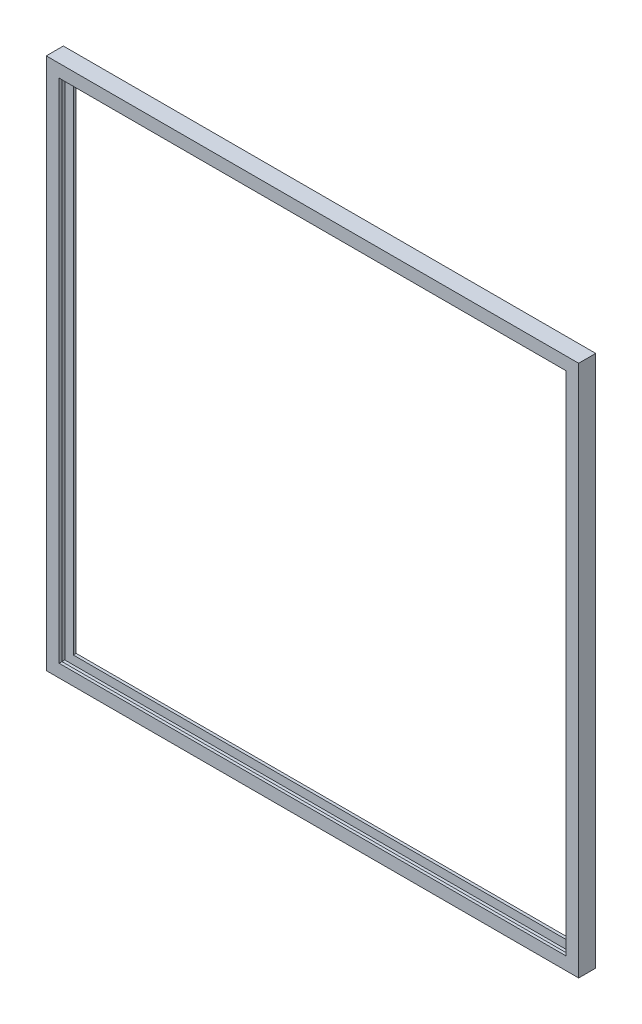
ISO-10303-21;
HEADER;
FILE_DESCRIPTION(('STEP AP214'),'2;1');
FILE_NAME('part.step','',(''),(''),'','','');
FILE_SCHEMA(('AUTOMOTIVE_DESIGN { 1 0 10303 214 1 1 1 1 }'));
ENDSEC;
DATA;
#1=APPLICATION_CONTEXT('core data for automotive mechanical design processes');
#2=APPLICATION_PROTOCOL_DEFINITION('international standard','automotive_design',2000,#1);
#3=PRODUCT_CONTEXT('',#1,'mechanical');
#4=PRODUCT('Part','Part','',(#3));
#5=PRODUCT_RELATED_PRODUCT_CATEGORY('part','',(#4));
#6=PRODUCT_DEFINITION_FORMATION('','',#4);
#7=PRODUCT_DEFINITION_CONTEXT('part definition',#1,'design');
#8=PRODUCT_DEFINITION('design','',#6,#7);
#9=PRODUCT_DEFINITION_SHAPE('','',#8);
#10=(LENGTH_UNIT() NAMED_UNIT(*) SI_UNIT(.MILLI.,.METRE.));
#11=(NAMED_UNIT(*) PLANE_ANGLE_UNIT() SI_UNIT($,.RADIAN.));
#12=(NAMED_UNIT(*) SI_UNIT($,.STERADIAN.) SOLID_ANGLE_UNIT());
#13=UNCERTAINTY_MEASURE_WITH_UNIT(LENGTH_MEASURE(1.E-05),#10,'distance_accuracy_value','');
#14=(GEOMETRIC_REPRESENTATION_CONTEXT(3) GLOBAL_UNCERTAINTY_ASSIGNED_CONTEXT((#13)) GLOBAL_UNIT_ASSIGNED_CONTEXT((#10,
#11,#12)) REPRESENTATION_CONTEXT('',''));
#15=CARTESIAN_POINT('',(0.,0.,0.));
#16=DIRECTION('',(0.,0.,1.));
#17=DIRECTION('',(1.,0.,0.));
#18=AXIS2_PLACEMENT_3D('',#15,#16,#17);
#19=CARTESIAN_POINT('',(-296.8625,593.725,9.525));
#20=DIRECTION('',(-1.,0.,0.));
#21=DIRECTION('',(0.,-1.,0.));
#22=AXIS2_PLACEMENT_3D('',#19,#20,#21);
#23=PLANE('',#22);
#24=DIRECTION('',(0.,-1.,0.));
#25=VECTOR('',#24,1.);
#26=CARTESIAN_POINT('',(-296.8625,593.725,-9.525));
#27=LINE('',#26,#25);
#28=CARTESIAN_POINT('',(-296.8625,593.725,-9.525));
#29=VERTEX_POINT('',#28);
#30=CARTESIAN_POINT('',(-296.8625,0.,-9.525));
#31=VERTEX_POINT('',#30);
#32=EDGE_CURVE('E106',#29,#31,#27,.T.);
#33=ORIENTED_EDGE('',*,*,#32,.T.);
#34=DIRECTION('',(0.,0.,-1.));
#35=VECTOR('',#34,1.);
#36=CARTESIAN_POINT('',(-296.8625,0.,9.525));
#37=LINE('',#36,#35);
#38=CARTESIAN_POINT('',(-296.8625,0.,9.525));
#39=VERTEX_POINT('',#38);
#40=EDGE_CURVE('E146',#39,#31,#37,.T.);
#41=ORIENTED_EDGE('',*,*,#40,.F.);
#42=DIRECTION('',(0.,-1.,0.));
#43=VECTOR('',#42,1.);
#44=CARTESIAN_POINT('',(-296.8625,593.725,9.525));
#45=LINE('',#44,#43);
#46=CARTESIAN_POINT('',(-296.8625,593.725,9.525));
#47=VERTEX_POINT('',#46);
#48=EDGE_CURVE('E121',#47,#39,#45,.T.);
#49=ORIENTED_EDGE('',*,*,#48,.F.);
#50=DIRECTION('',(0.,0.,-1.));
#51=VECTOR('',#50,1.);
#52=CARTESIAN_POINT('',(-296.8625,593.725,9.525));
#53=LINE('',#52,#51);
#54=EDGE_CURVE('E240',#47,#29,#53,.T.);
#55=ORIENTED_EDGE('',*,*,#54,.T.);
#56=EDGE_LOOP('',(#33,#41,#49,#55));
#57=FACE_BOUND('',#56,.T.);
#58=ADVANCED_FACE('F34',(#57),#23,.T.);
#59=CARTESIAN_POINT('',(-282.575,593.725,6.35));
#60=DIRECTION('',(1.,0.,0.));
#61=DIRECTION('',(0.,1.,0.));
#62=AXIS2_PLACEMENT_3D('',#59,#60,#61);
#63=PLANE('',#62);
#64=DIRECTION('',(0.,-1.,0.));
#65=VECTOR('',#64,1.);
#66=CARTESIAN_POINT('',(-282.575,593.725,9.525));
#67=LINE('',#66,#65);
#68=CARTESIAN_POINT('',(-282.575,579.4375,9.525));
#69=VERTEX_POINT('',#68);
#70=CARTESIAN_POINT('',(-282.575,14.2875,9.525));
#71=VERTEX_POINT('',#70);
#72=EDGE_CURVE('E111',#69,#71,#67,.T.);
#73=ORIENTED_EDGE('',*,*,#72,.T.);
#74=DIRECTION('',(0.,0.,-1.));
#75=VECTOR('',#74,1.);
#76=CARTESIAN_POINT('',(-282.575,14.2875,6.35));
#77=LINE('',#76,#75);
#78=CARTESIAN_POINT('',(-282.575,14.2875,6.35));
#79=VERTEX_POINT('',#78);
#80=EDGE_CURVE('E113',#71,#79,#77,.T.);
#81=ORIENTED_EDGE('',*,*,#80,.T.);
#82=DIRECTION('',(0.,-1.,0.));
#83=VECTOR('',#82,1.);
#84=CARTESIAN_POINT('',(-282.575,593.725,6.35));
#85=LINE('',#84,#83);
#86=CARTESIAN_POINT('',(-282.575,579.4375,6.35));
#87=VERTEX_POINT('',#86);
#88=EDGE_CURVE('E122',#87,#79,#85,.T.);
#89=ORIENTED_EDGE('',*,*,#88,.F.);
#90=DIRECTION('',(0.,0.,-1.));
#91=VECTOR('',#90,1.);
#92=CARTESIAN_POINT('',(-282.575,579.4375,6.35));
#93=LINE('',#92,#91);
#94=EDGE_CURVE('E116',#69,#87,#93,.T.);
#95=ORIENTED_EDGE('',*,*,#94,.F.);
#96=EDGE_LOOP('',(#73,#81,#89,#95));
#97=FACE_BOUND('',#96,.T.);
#98=ADVANCED_FACE('F36',(#97),#63,.T.);
#99=CARTESIAN_POINT('',(-282.575,593.725,-9.525));
#100=DIRECTION('',(1.,0.,0.));
#101=DIRECTION('',(0.,0.,-1.));
#102=AXIS2_PLACEMENT_3D('',#99,#100,#101);
#103=PLANE('',#102);
#104=DIRECTION('',(0.,-1.,0.));
#105=VECTOR('',#104,1.);
#106=CARTESIAN_POINT('',(-282.575,593.725,-6.35));
#107=LINE('',#106,#105);
#108=CARTESIAN_POINT('',(-282.575,579.4375,-6.35));
#109=VERTEX_POINT('',#108);
#110=CARTESIAN_POINT('',(-282.575,14.2875,-6.35));
#111=VERTEX_POINT('',#110);
#112=EDGE_CURVE('E170',#109,#111,#107,.T.);
#113=ORIENTED_EDGE('',*,*,#112,.T.);
#114=DIRECTION('',(0.,0.,-1.));
#115=VECTOR('',#114,1.);
#116=CARTESIAN_POINT('',(-282.575,14.2875,-9.52499999999998));
#117=LINE('',#116,#115);
#118=CARTESIAN_POINT('',(-282.575,14.2875,-9.525));
#119=VERTEX_POINT('',#118);
#120=EDGE_CURVE('E162',#111,#119,#117,.T.);
#121=ORIENTED_EDGE('',*,*,#120,.T.);
#122=DIRECTION('',(0.,-1.,0.));
#123=VECTOR('',#122,1.);
#124=CARTESIAN_POINT('',(-282.575,593.725,-9.525));
#125=LINE('',#124,#123);
#126=CARTESIAN_POINT('',(-282.575,579.4375,-9.525));
#127=VERTEX_POINT('',#126);
#128=EDGE_CURVE('E166',#127,#119,#125,.T.);
#129=ORIENTED_EDGE('',*,*,#128,.F.);
#130=DIRECTION('',(0.,0.,-1.));
#131=VECTOR('',#130,1.);
#132=CARTESIAN_POINT('',(-282.575,579.4375,-9.52500000000063));
#133=LINE('',#132,#131);
#134=EDGE_CURVE('E133',#109,#127,#133,.T.);
#135=ORIENTED_EDGE('',*,*,#134,.F.);
#136=EDGE_LOOP('',(#113,#121,#129,#135));
#137=FACE_BOUND('',#136,.T.);
#138=ADVANCED_FACE('F266',(#137),#103,.T.);
#139=CARTESIAN_POINT('',(-292.1,593.725,-6.35));
#140=DIRECTION('',(1.,0.,0.));
#141=DIRECTION('',(0.,1.,0.));
#142=AXIS2_PLACEMENT_3D('',#139,#140,#141);
#143=PLANE('',#142);
#144=DIRECTION('',(0.,-1.,0.));
#145=VECTOR('',#144,1.);
#146=CARTESIAN_POINT('',(-292.1,593.725,6.35));
#147=LINE('',#146,#145);
#148=CARTESIAN_POINT('',(-292.1,588.9625,6.35));
#149=VERTEX_POINT('',#148);
#150=CARTESIAN_POINT('',(-292.1,4.76249999999997,6.35));
#151=VERTEX_POINT('',#150);
#152=EDGE_CURVE('E38',#149,#151,#147,.T.);
#153=ORIENTED_EDGE('',*,*,#152,.T.);
#154=DIRECTION('',(0.,0.,-1.));
#155=VECTOR('',#154,1.);
#156=CARTESIAN_POINT('',(-292.1,4.76249999999995,-6.35));
#157=LINE('',#156,#155);
#158=CARTESIAN_POINT('',(-292.1,4.76249999999998,-6.35));
#159=VERTEX_POINT('',#158);
#160=EDGE_CURVE('E134',#151,#159,#157,.T.);
#161=ORIENTED_EDGE('',*,*,#160,.T.);
#162=DIRECTION('',(0.,-1.,0.));
#163=VECTOR('',#162,1.);
#164=CARTESIAN_POINT('',(-292.1,593.725,-6.35));
#165=LINE('',#164,#163);
#166=CARTESIAN_POINT('',(-292.1,588.9625,-6.35));
#167=VERTEX_POINT('',#166);
#168=EDGE_CURVE('E171',#167,#159,#165,.T.);
#169=ORIENTED_EDGE('',*,*,#168,.F.);
#170=DIRECTION('',(0.,0.,-1.));
#171=VECTOR('',#170,1.);
#172=CARTESIAN_POINT('',(-292.1,588.9625,-6.35000000000008));
#173=LINE('',#172,#171);
#174=EDGE_CURVE('E247',#149,#167,#173,.T.);
#175=ORIENTED_EDGE('',*,*,#174,.F.);
#176=EDGE_LOOP('',(#153,#161,#169,#175));
#177=FACE_BOUND('',#176,.T.);
#178=ADVANCED_FACE('F344',(#177),#143,.T.);
#179=CARTESIAN_POINT('',(-296.8625,0.,9.525));
#180=DIRECTION('',(0.,-1.,0.));
#181=DIRECTION('',(0.,0.,-1.));
#182=AXIS2_PLACEMENT_3D('',#179,#180,#181);
#183=PLANE('',#182);
#184=DIRECTION('',(1.,0.,0.));
#185=VECTOR('',#184,1.);
#186=CARTESIAN_POINT('',(-296.8625,0.,-9.525));
#187=LINE('',#186,#185);
#188=CARTESIAN_POINT('',(296.8625,0.,-9.525));
#189=VERTEX_POINT('',#188);
#190=EDGE_CURVE('E144',#31,#189,#187,.T.);
#191=ORIENTED_EDGE('',*,*,#190,.T.);
#192=DIRECTION('',(0.,0.,-1.));
#193=VECTOR('',#192,1.);
#194=CARTESIAN_POINT('',(296.8625,1.11022302462516E-13,9.525));
#195=LINE('',#194,#193);
#196=CARTESIAN_POINT('',(296.8625,0.,9.525));
#197=VERTEX_POINT('',#196);
#198=EDGE_CURVE('E190',#197,#189,#195,.T.);
#199=ORIENTED_EDGE('',*,*,#198,.F.);
#200=DIRECTION('',(1.,0.,0.));
#201=VECTOR('',#200,1.);
#202=CARTESIAN_POINT('',(-296.8625,0.,9.525));
#203=LINE('',#202,#201);
#204=EDGE_CURVE('E141',#39,#197,#203,.T.);
#205=ORIENTED_EDGE('',*,*,#204,.F.);
#206=ORIENTED_EDGE('',*,*,#40,.T.);
#207=EDGE_LOOP('',(#191,#199,#205,#206));
#208=FACE_BOUND('',#207,.T.);
#209=ADVANCED_FACE('F188',(#208),#183,.T.);
#210=CARTESIAN_POINT('',(-296.8625,14.2874999999999,6.35));
#211=DIRECTION('',(0.,1.,0.));
#212=DIRECTION('',(-1.,0.,0.));
#213=AXIS2_PLACEMENT_3D('',#210,#211,#212);
#214=PLANE('',#213);
#215=DIRECTION('',(1.,0.,0.));
#216=VECTOR('',#215,1.);
#217=CARTESIAN_POINT('',(-296.8625,14.2874999999999,9.525));
#218=LINE('',#217,#216);
#219=CARTESIAN_POINT('',(282.575,14.2875000000002,9.525));
#220=VERTEX_POINT('',#219);
#221=EDGE_CURVE('E129',#71,#220,#218,.T.);
#222=ORIENTED_EDGE('',*,*,#221,.T.);
#223=DIRECTION('',(0.,0.,-1.));
#224=VECTOR('',#223,1.);
#225=CARTESIAN_POINT('',(282.575,14.2875000000003,6.35));
#226=LINE('',#225,#224);
#227=CARTESIAN_POINT('',(282.575,14.2875000000002,6.35));
#228=VERTEX_POINT('',#227);
#229=EDGE_CURVE('E224',#220,#228,#226,.T.);
#230=ORIENTED_EDGE('',*,*,#229,.T.);
#231=DIRECTION('',(1.,0.,0.));
#232=VECTOR('',#231,1.);
#233=CARTESIAN_POINT('',(-296.8625,14.2874999999999,6.35));
#234=LINE('',#233,#232);
#235=EDGE_CURVE('E132',#79,#228,#234,.T.);
#236=ORIENTED_EDGE('',*,*,#235,.F.);
#237=ORIENTED_EDGE('',*,*,#80,.F.);
#238=EDGE_LOOP('',(#222,#230,#236,#237));
#239=FACE_BOUND('',#238,.T.);
#240=ADVANCED_FACE('F127',(#239),#214,.T.);
#241=CARTESIAN_POINT('',(-296.8625,14.2875,-9.525));
#242=DIRECTION('',(0.,1.,0.));
#243=DIRECTION('',(0.,0.,1.));
#244=AXIS2_PLACEMENT_3D('',#241,#242,#243);
#245=PLANE('',#244);
#246=DIRECTION('',(1.,0.,0.));
#247=VECTOR('',#246,1.);
#248=CARTESIAN_POINT('',(-296.8625,14.2874999999999,-6.35));
#249=LINE('',#248,#247);
#250=CARTESIAN_POINT('',(282.575,14.2875000000002,-6.35));
#251=VERTEX_POINT('',#250);
#252=EDGE_CURVE('E153',#111,#251,#249,.T.);
#253=ORIENTED_EDGE('',*,*,#252,.T.);
#254=DIRECTION('',(0.,0.,-1.));
#255=VECTOR('',#254,1.);
#256=CARTESIAN_POINT('',(282.575,14.2875000000003,-9.52499999999998));
#257=LINE('',#256,#255);
#258=CARTESIAN_POINT('',(282.575,14.2875000000001,-9.525));
#259=VERTEX_POINT('',#258);
#260=EDGE_CURVE('E204',#251,#259,#257,.T.);
#261=ORIENTED_EDGE('',*,*,#260,.T.);
#262=DIRECTION('',(1.,0.,0.));
#263=VECTOR('',#262,1.);
#264=CARTESIAN_POINT('',(-296.8625,14.2875,-9.525));
#265=LINE('',#264,#263);
#266=EDGE_CURVE('E150',#119,#259,#265,.T.);
#267=ORIENTED_EDGE('',*,*,#266,.F.);
#268=ORIENTED_EDGE('',*,*,#120,.F.);
#269=EDGE_LOOP('',(#253,#261,#267,#268));
#270=FACE_BOUND('',#269,.T.);
#271=ADVANCED_FACE('F273',(#270),#245,.T.);
#272=CARTESIAN_POINT('',(-296.8625,4.76249999999995,-6.35));
#273=DIRECTION('',(0.,1.,0.));
#274=DIRECTION('',(-1.,0.,0.));
#275=AXIS2_PLACEMENT_3D('',#272,#273,#274);
#276=PLANE('',#275);
#277=DIRECTION('',(1.,0.,0.));
#278=VECTOR('',#277,1.);
#279=CARTESIAN_POINT('',(-296.8625,4.76249999999994,6.35));
#280=LINE('',#279,#278);
#281=CARTESIAN_POINT('',(292.1,4.76250000000016,6.35));
#282=VERTEX_POINT('',#281);
#283=EDGE_CURVE('E159',#151,#282,#280,.T.);
#284=ORIENTED_EDGE('',*,*,#283,.T.);
#285=DIRECTION('',(0.,0.,-1.));
#286=VECTOR('',#285,1.);
#287=CARTESIAN_POINT('',(292.1,4.76250000000028,-6.35));
#288=LINE('',#287,#286);
#289=CARTESIAN_POINT('',(292.1,4.76250000000014,-6.35));
#290=VERTEX_POINT('',#289);
#291=EDGE_CURVE('E221',#282,#290,#288,.T.);
#292=ORIENTED_EDGE('',*,*,#291,.T.);
#293=DIRECTION('',(1.,0.,0.));
#294=VECTOR('',#293,1.);
#295=CARTESIAN_POINT('',(-296.8625,4.76249999999995,-6.35));
#296=LINE('',#295,#294);
#297=EDGE_CURVE('E156',#159,#290,#296,.T.);
#298=ORIENTED_EDGE('',*,*,#297,.F.);
#299=ORIENTED_EDGE('',*,*,#160,.F.);
#300=EDGE_LOOP('',(#284,#292,#298,#299));
#301=FACE_BOUND('',#300,.T.);
#302=ADVANCED_FACE('F319',(#301),#276,.T.);
#303=CARTESIAN_POINT('',(296.8625,593.725,9.525));
#304=DIRECTION('',(0.,1.,0.));
#305=DIRECTION('',(-1.,0.,0.));
#306=AXIS2_PLACEMENT_3D('',#303,#304,#305);
#307=PLANE('',#306);
#308=DIRECTION('',(-1.,0.,0.));
#309=VECTOR('',#308,1.);
#310=CARTESIAN_POINT('',(296.8625,593.725,-9.525));
#311=LINE('',#310,#309);
#312=CARTESIAN_POINT('',(296.8625,593.725,-9.525));
#313=VERTEX_POINT('',#312);
#314=EDGE_CURVE('E210',#313,#29,#311,.T.);
#315=ORIENTED_EDGE('',*,*,#314,.T.);
#316=ORIENTED_EDGE('',*,*,#54,.F.);
#317=DIRECTION('',(-1.,0.,0.));
#318=VECTOR('',#317,1.);
#319=CARTESIAN_POINT('',(296.8625,593.725,9.525));
#320=LINE('',#319,#318);
#321=CARTESIAN_POINT('',(296.8625,593.725,9.525));
#322=VERTEX_POINT('',#321);
#323=EDGE_CURVE('E53',#322,#47,#320,.T.);
#324=ORIENTED_EDGE('',*,*,#323,.F.);
#325=DIRECTION('',(0.,0.,-1.));
#326=VECTOR('',#325,1.);
#327=CARTESIAN_POINT('',(296.8625,593.725,9.525));
#328=LINE('',#327,#326);
#329=EDGE_CURVE('E212',#322,#313,#328,.T.);
#330=ORIENTED_EDGE('',*,*,#329,.T.);
#331=EDGE_LOOP('',(#315,#316,#324,#330));
#332=FACE_BOUND('',#331,.T.);
#333=ADVANCED_FACE('F300',(#332),#307,.T.);
#334=CARTESIAN_POINT('',(296.8625,579.4375,6.35));
#335=DIRECTION('',(0.,-1.,0.));
#336=DIRECTION('',(1.,0.,0.));
#337=AXIS2_PLACEMENT_3D('',#334,#335,#336);
#338=PLANE('',#337);
#339=DIRECTION('',(-1.,0.,0.));
#340=VECTOR('',#339,1.);
#341=CARTESIAN_POINT('',(296.8625,579.4375,9.525));
#342=LINE('',#341,#340);
#343=CARTESIAN_POINT('',(282.575,579.4375,9.525));
#344=VERTEX_POINT('',#343);
#345=EDGE_CURVE('E241',#344,#69,#342,.T.);
#346=ORIENTED_EDGE('',*,*,#345,.T.);
#347=ORIENTED_EDGE('',*,*,#94,.T.);
#348=DIRECTION('',(-1.,0.,0.));
#349=VECTOR('',#348,1.);
#350=CARTESIAN_POINT('',(296.8625,579.4375,6.35));
#351=LINE('',#350,#349);
#352=CARTESIAN_POINT('',(282.575,579.4375,6.35));
#353=VERTEX_POINT('',#352);
#354=EDGE_CURVE('E246',#353,#87,#351,.T.);
#355=ORIENTED_EDGE('',*,*,#354,.F.);
#356=DIRECTION('',(0.,0.,-1.));
#357=VECTOR('',#356,1.);
#358=CARTESIAN_POINT('',(282.575,579.4375,6.35));
#359=LINE('',#358,#357);
#360=EDGE_CURVE('E238',#344,#353,#359,.T.);
#361=ORIENTED_EDGE('',*,*,#360,.F.);
#362=EDGE_LOOP('',(#346,#347,#355,#361));
#363=FACE_BOUND('',#362,.T.);
#364=ADVANCED_FACE('F292',(#363),#338,.T.);
#365=CARTESIAN_POINT('',(296.8625,579.4375,-9.525));
#366=DIRECTION('',(0.,-1.,0.));
#367=DIRECTION('',(0.,0.,-1.));
#368=AXIS2_PLACEMENT_3D('',#365,#366,#367);
#369=PLANE('',#368);
#370=DIRECTION('',(-1.,0.,0.));
#371=VECTOR('',#370,1.);
#372=CARTESIAN_POINT('',(296.8625,579.4375,-6.35));
#373=LINE('',#372,#371);
#374=CARTESIAN_POINT('',(282.575,579.4375,-6.35));
#375=VERTEX_POINT('',#374);
#376=EDGE_CURVE('E257',#375,#109,#373,.T.);
#377=ORIENTED_EDGE('',*,*,#376,.T.);
#378=ORIENTED_EDGE('',*,*,#134,.T.);
#379=DIRECTION('',(-1.,0.,0.));
#380=VECTOR('',#379,1.);
#381=CARTESIAN_POINT('',(296.8625,579.4375,-9.525));
#382=LINE('',#381,#380);
#383=CARTESIAN_POINT('',(282.575,579.4375,-9.525));
#384=VERTEX_POINT('',#383);
#385=EDGE_CURVE('E244',#384,#127,#382,.T.);
#386=ORIENTED_EDGE('',*,*,#385,.F.);
#387=DIRECTION('',(0.,0.,-1.));
#388=VECTOR('',#387,1.);
#389=CARTESIAN_POINT('',(282.575,579.4375,-9.52500000000063));
#390=LINE('',#389,#388);
#391=EDGE_CURVE('E11',#375,#384,#390,.T.);
#392=ORIENTED_EDGE('',*,*,#391,.F.);
#393=EDGE_LOOP('',(#377,#378,#386,#392));
#394=FACE_BOUND('',#393,.T.);
#395=ADVANCED_FACE('F289',(#394),#369,.T.);
#396=CARTESIAN_POINT('',(296.8625,588.9625,-6.35));
#397=DIRECTION('',(0.,-1.,0.));
#398=DIRECTION('',(1.,0.,0.));
#399=AXIS2_PLACEMENT_3D('',#396,#397,#398);
#400=PLANE('',#399);
#401=DIRECTION('',(-1.,0.,0.));
#402=VECTOR('',#401,1.);
#403=CARTESIAN_POINT('',(296.8625,588.9625,6.35));
#404=LINE('',#403,#402);
#405=CARTESIAN_POINT('',(292.1,588.9625,6.35));
#406=VERTEX_POINT('',#405);
#407=EDGE_CURVE('E226',#406,#149,#404,.T.);
#408=ORIENTED_EDGE('',*,*,#407,.T.);
#409=ORIENTED_EDGE('',*,*,#174,.T.);
#410=DIRECTION('',(-1.,0.,0.));
#411=VECTOR('',#410,1.);
#412=CARTESIAN_POINT('',(296.8625,588.9625,-6.35));
#413=LINE('',#412,#411);
#414=CARTESIAN_POINT('',(292.1,588.9625,-6.35));
#415=VERTEX_POINT('',#414);
#416=EDGE_CURVE('E260',#415,#167,#413,.T.);
#417=ORIENTED_EDGE('',*,*,#416,.F.);
#418=DIRECTION('',(0.,0.,-1.));
#419=VECTOR('',#418,1.);
#420=CARTESIAN_POINT('',(292.1,588.9625,-6.35000000000008));
#421=LINE('',#420,#419);
#422=EDGE_CURVE('E44',#406,#415,#421,.T.);
#423=ORIENTED_EDGE('',*,*,#422,.F.);
#424=EDGE_LOOP('',(#408,#409,#417,#423));
#425=FACE_BOUND('',#424,.T.);
#426=ADVANCED_FACE('F291',(#425),#400,.T.);
#427=CARTESIAN_POINT('',(296.8625,1.11022302462516E-13,9.525));
#428=DIRECTION('',(1.,0.,0.));
#429=DIRECTION('',(0.,1.,0.));
#430=AXIS2_PLACEMENT_3D('',#427,#428,#429);
#431=PLANE('',#430);
#432=DIRECTION('',(0.,1.,0.));
#433=VECTOR('',#432,1.);
#434=CARTESIAN_POINT('',(296.8625,1.11022302462516E-13,-9.525));
#435=LINE('',#434,#433);
#436=EDGE_CURVE('E200',#189,#313,#435,.T.);
#437=ORIENTED_EDGE('',*,*,#436,.T.);
#438=ORIENTED_EDGE('',*,*,#329,.F.);
#439=DIRECTION('',(0.,1.,0.));
#440=VECTOR('',#439,1.);
#441=CARTESIAN_POINT('',(296.8625,1.11022302462516E-13,9.525));
#442=LINE('',#441,#440);
#443=EDGE_CURVE('E202',#197,#322,#442,.T.);
#444=ORIENTED_EDGE('',*,*,#443,.F.);
#445=ORIENTED_EDGE('',*,*,#198,.T.);
#446=EDGE_LOOP('',(#437,#438,#444,#445));
#447=FACE_BOUND('',#446,.T.);
#448=ADVANCED_FACE('F198',(#447),#431,.T.);
#449=CARTESIAN_POINT('',(282.575,1.08397731291093E-13,6.35));
#450=DIRECTION('',(-1.,0.,0.));
#451=DIRECTION('',(0.,-1.,0.));
#452=AXIS2_PLACEMENT_3D('',#449,#450,#451);
#453=PLANE('',#452);
#454=ORIENTED_EDGE('',*,*,#229,.F.);
#455=DIRECTION('',(0.,1.,0.));
#456=VECTOR('',#455,1.);
#457=CARTESIAN_POINT('',(282.575,1.08397731291093E-13,9.525));
#458=LINE('',#457,#456);
#459=EDGE_CURVE('E140',#220,#344,#458,.T.);
#460=ORIENTED_EDGE('',*,*,#459,.T.);
#461=ORIENTED_EDGE('',*,*,#360,.T.);
#462=DIRECTION('',(0.,1.,0.));
#463=VECTOR('',#462,1.);
#464=CARTESIAN_POINT('',(282.575,1.08397731291093E-13,6.35));
#465=LINE('',#464,#463);
#466=EDGE_CURVE('E203',#228,#353,#465,.T.);
#467=ORIENTED_EDGE('',*,*,#466,.F.);
#468=EDGE_LOOP('',(#454,#460,#461,#467));
#469=FACE_BOUND('',#468,.T.);
#470=ADVANCED_FACE('F395',(#469),#453,.T.);
#471=CARTESIAN_POINT('',(282.575,1.08397731291093E-13,9.525));
#472=DIRECTION('',(0.,0.,1.));
#473=DIRECTION('',(1.,0.,0.));
#474=AXIS2_PLACEMENT_3D('',#471,#472,#473);
#475=PLANE('',#474);
#476=ORIENTED_EDGE('',*,*,#221,.F.);
#477=ORIENTED_EDGE('',*,*,#72,.F.);
#478=ORIENTED_EDGE('',*,*,#345,.F.);
#479=ORIENTED_EDGE('',*,*,#459,.F.);
#480=EDGE_LOOP('',(#476,#477,#478,#479));
#481=FACE_BOUND('',#480,.T.);
#482=ORIENTED_EDGE('',*,*,#48,.T.);
#483=ORIENTED_EDGE('',*,*,#204,.T.);
#484=ORIENTED_EDGE('',*,*,#443,.T.);
#485=ORIENTED_EDGE('',*,*,#323,.T.);
#486=EDGE_LOOP('',(#482,#483,#484,#485));
#487=FACE_BOUND('',#486,.T.);
#488=ADVANCED_FACE('F137',(#481,#487),#475,.T.);
#489=CARTESIAN_POINT('',(296.8625,1.11022302462516E-13,-9.525));
#490=DIRECTION('',(0.,0.,-1.));
#491=DIRECTION('',(-1.,0.,0.));
#492=AXIS2_PLACEMENT_3D('',#489,#490,#491);
#493=PLANE('',#492);
#494=ORIENTED_EDGE('',*,*,#190,.F.);
#495=ORIENTED_EDGE('',*,*,#32,.F.);
#496=ORIENTED_EDGE('',*,*,#314,.F.);
#497=ORIENTED_EDGE('',*,*,#436,.F.);
#498=EDGE_LOOP('',(#494,#495,#496,#497));
#499=FACE_BOUND('',#498,.T.);
#500=ORIENTED_EDGE('',*,*,#128,.T.);
#501=ORIENTED_EDGE('',*,*,#266,.T.);
#502=DIRECTION('',(0.,1.,0.));
#503=VECTOR('',#502,1.);
#504=CARTESIAN_POINT('',(282.575,1.08397731291093E-13,-9.525));
#505=LINE('',#504,#503);
#506=EDGE_CURVE('E211',#259,#384,#505,.T.);
#507=ORIENTED_EDGE('',*,*,#506,.T.);
#508=ORIENTED_EDGE('',*,*,#385,.T.);
#509=EDGE_LOOP('',(#500,#501,#507,#508));
#510=FACE_BOUND('',#509,.T.);
#511=ADVANCED_FACE('F207',(#499,#510),#493,.T.);
#512=CARTESIAN_POINT('',(282.575,1.08397731291093E-13,-9.525));
#513=DIRECTION('',(-1.,0.,0.));
#514=DIRECTION('',(0.,0.,1.));
#515=AXIS2_PLACEMENT_3D('',#512,#513,#514);
#516=PLANE('',#515);
#517=ORIENTED_EDGE('',*,*,#260,.F.);
#518=DIRECTION('',(0.,1.,0.));
#519=VECTOR('',#518,1.);
#520=CARTESIAN_POINT('',(282.575,1.08397731291093E-13,-6.35));
#521=LINE('',#520,#519);
#522=EDGE_CURVE('E215',#251,#375,#521,.T.);
#523=ORIENTED_EDGE('',*,*,#522,.T.);
#524=ORIENTED_EDGE('',*,*,#391,.T.);
#525=ORIENTED_EDGE('',*,*,#506,.F.);
#526=EDGE_LOOP('',(#517,#523,#524,#525));
#527=FACE_BOUND('',#526,.T.);
#528=ADVANCED_FACE('F280',(#527),#516,.T.);
#529=CARTESIAN_POINT('',(282.575,1.08397731291093E-13,-6.35));
#530=DIRECTION('',(0.,0.,1.));
#531=DIRECTION('',(1.,0.,0.));
#532=AXIS2_PLACEMENT_3D('',#529,#530,#531);
#533=PLANE('',#532);
#534=ORIENTED_EDGE('',*,*,#252,.F.);
#535=ORIENTED_EDGE('',*,*,#112,.F.);
#536=ORIENTED_EDGE('',*,*,#376,.F.);
#537=ORIENTED_EDGE('',*,*,#522,.F.);
#538=EDGE_LOOP('',(#534,#535,#536,#537));
#539=FACE_BOUND('',#538,.T.);
#540=ORIENTED_EDGE('',*,*,#168,.T.);
#541=ORIENTED_EDGE('',*,*,#297,.T.);
#542=DIRECTION('',(0.,1.,0.));
#543=VECTOR('',#542,1.);
#544=CARTESIAN_POINT('',(292.1,1.10147445405375E-13,-6.35));
#545=LINE('',#544,#543);
#546=EDGE_CURVE('E232',#290,#415,#545,.T.);
#547=ORIENTED_EDGE('',*,*,#546,.T.);
#548=ORIENTED_EDGE('',*,*,#416,.T.);
#549=EDGE_LOOP('',(#540,#541,#547,#548));
#550=FACE_BOUND('',#549,.T.);
#551=ADVANCED_FACE('F285',(#539,#550),#533,.T.);
#552=CARTESIAN_POINT('',(292.1,1.10147445405375E-13,-6.35));
#553=DIRECTION('',(-1.,0.,0.));
#554=DIRECTION('',(0.,-1.,0.));
#555=AXIS2_PLACEMENT_3D('',#552,#553,#554);
#556=PLANE('',#555);
#557=ORIENTED_EDGE('',*,*,#291,.F.);
#558=DIRECTION('',(0.,1.,0.));
#559=VECTOR('',#558,1.);
#560=CARTESIAN_POINT('',(292.1,1.10147445405375E-13,6.35));
#561=LINE('',#560,#559);
#562=EDGE_CURVE('E235',#282,#406,#561,.T.);
#563=ORIENTED_EDGE('',*,*,#562,.T.);
#564=ORIENTED_EDGE('',*,*,#422,.T.);
#565=ORIENTED_EDGE('',*,*,#546,.F.);
#566=EDGE_LOOP('',(#557,#563,#564,#565));
#567=FACE_BOUND('',#566,.T.);
#568=ADVANCED_FACE('F306',(#567),#556,.T.);
#569=CARTESIAN_POINT('',(292.1,1.10147445405375E-13,6.35));
#570=DIRECTION('',(0.,0.,-1.));
#571=DIRECTION('',(-1.,0.,0.));
#572=AXIS2_PLACEMENT_3D('',#569,#570,#571);
#573=PLANE('',#572);
#574=ORIENTED_EDGE('',*,*,#283,.F.);
#575=ORIENTED_EDGE('',*,*,#152,.F.);
#576=ORIENTED_EDGE('',*,*,#407,.F.);
#577=ORIENTED_EDGE('',*,*,#562,.F.);
#578=EDGE_LOOP('',(#574,#575,#576,#577));
#579=FACE_BOUND('',#578,.T.);
#580=ORIENTED_EDGE('',*,*,#88,.T.);
#581=ORIENTED_EDGE('',*,*,#235,.T.);
#582=ORIENTED_EDGE('',*,*,#466,.T.);
#583=ORIENTED_EDGE('',*,*,#354,.T.);
#584=EDGE_LOOP('',(#580,#581,#582,#583));
#585=FACE_BOUND('',#584,.T.);
#586=ADVANCED_FACE('F304',(#579,#585),#573,.T.);
#587=CLOSED_SHELL('',(#58,#98,#138,#178,#209,#240,#271,#302,#333,#364,#395,#426,#448,#470,#488,
#511,#528,#551,#568,#586));
#588=MANIFOLD_SOLID_BREP('B2',#587);
#589=ADVANCED_BREP_SHAPE_REPRESENTATION('',(#18,#588),#14);
#590=SHAPE_DEFINITION_REPRESENTATION(#9,#589);
ENDSEC;
END-ISO-10303-21;
